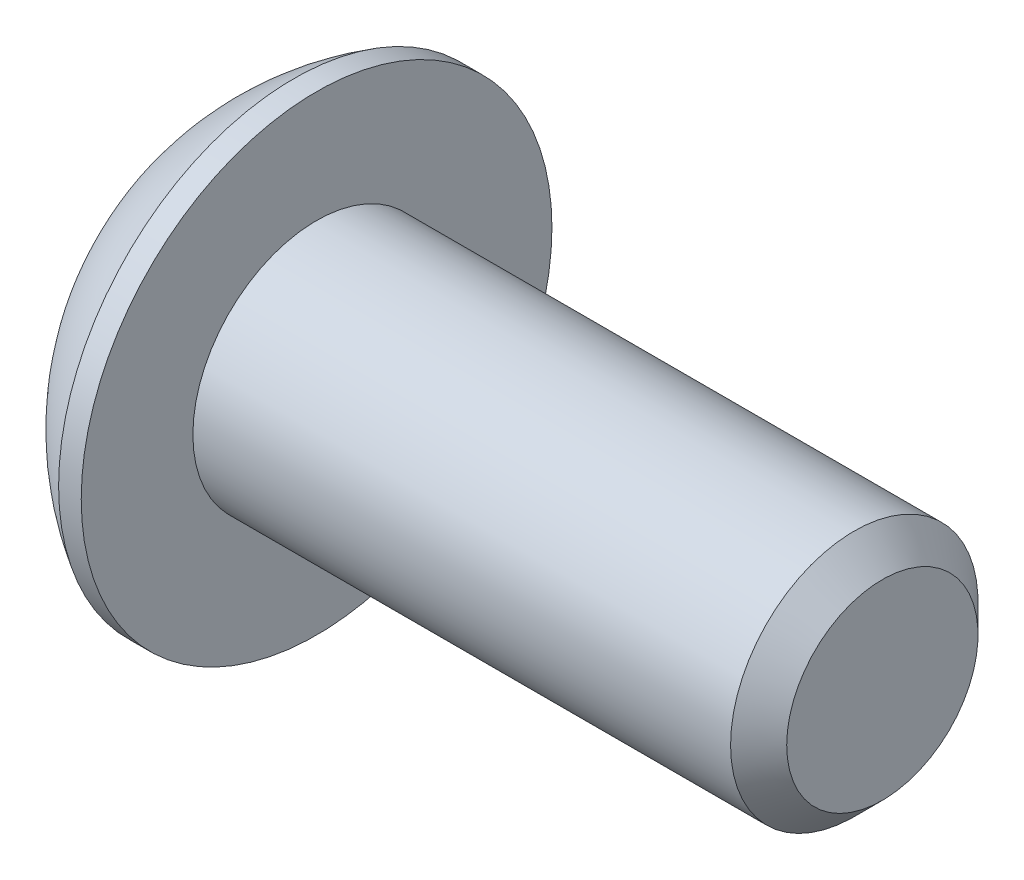
ISO-10303-21;
HEADER;
FILE_DESCRIPTION(('STEP AP214'),'2;1');
FILE_NAME('part.step','',(''),(''),'','','');
FILE_SCHEMA(('AUTOMOTIVE_DESIGN { 1 0 10303 214 1 1 1 1 }'));
ENDSEC;
DATA;
#1=APPLICATION_CONTEXT('core data for automotive mechanical design processes');
#2=APPLICATION_PROTOCOL_DEFINITION('international standard','automotive_design',2000,#1);
#3=PRODUCT_CONTEXT('',#1,'mechanical');
#4=PRODUCT('Part','Part','',(#3));
#5=PRODUCT_RELATED_PRODUCT_CATEGORY('part','',(#4));
#6=PRODUCT_DEFINITION_FORMATION('','',#4);
#7=PRODUCT_DEFINITION_CONTEXT('part definition',#1,'design');
#8=PRODUCT_DEFINITION('design','',#6,#7);
#9=PRODUCT_DEFINITION_SHAPE('','',#8);
#10=(LENGTH_UNIT() NAMED_UNIT(*) SI_UNIT(.MILLI.,.METRE.));
#11=(NAMED_UNIT(*) PLANE_ANGLE_UNIT() SI_UNIT($,.RADIAN.));
#12=(NAMED_UNIT(*) SI_UNIT($,.STERADIAN.) SOLID_ANGLE_UNIT());
#13=UNCERTAINTY_MEASURE_WITH_UNIT(LENGTH_MEASURE(1.E-05),#10,'distance_accuracy_value','');
#14=(GEOMETRIC_REPRESENTATION_CONTEXT(3) GLOBAL_UNCERTAINTY_ASSIGNED_CONTEXT((#13)) GLOBAL_UNIT_ASSIGNED_CONTEXT((#10,
#11,#12)) REPRESENTATION_CONTEXT('',''));
#15=CARTESIAN_POINT('',(0.,0.,0.));
#16=DIRECTION('',(0.,0.,1.));
#17=DIRECTION('',(1.,0.,0.));
#18=AXIS2_PLACEMENT_3D('',#15,#16,#17);
#19=CARTESIAN_POINT('',(1.32079999997359,0.,0.));
#20=DIRECTION('',(-1.,0.,0.));
#21=DIRECTION('',(0.,0.,1.));
#22=AXIS2_PLACEMENT_3D('',#19,#20,#21);
#23=CONICAL_SURFACE('',#22,1.19380000001001,1.04719755119008);
#24=CARTESIAN_POINT('',(2.0100407513155,0.,0.));
#25=VERTEX_POINT('',#24);
#26=VERTEX_LOOP('',#25);
#27=FACE_BOUND('',#26,.T.);
#28=CARTESIAN_POINT('',(1.32079999997359,0.,0.));
#29=DIRECTION('',(-1.,0.,0.));
#30=DIRECTION('',(0.,0.,1.));
#31=AXIS2_PLACEMENT_3D('',#28,#29,#30);
#32=CIRCLE('',#31,1.19380000001001);
#33=CARTESIAN_POINT('',(1.32079999998682,-1.0338611270422,0.596900000002503));
#34=VERTEX_POINT('',#33);
#35=CARTESIAN_POINT('',(1.32079999998682,0.,1.19380000000501));
#36=VERTEX_POINT('',#35);
#37=EDGE_CURVE('E92',#34,#36,#32,.T.);
#38=ORIENTED_EDGE('',*,*,#37,.T.);
#39=CARTESIAN_POINT('',(1.32079999997359,0.,0.));
#40=DIRECTION('',(-1.,0.,0.));
#41=DIRECTION('',(0.,0.,1.));
#42=AXIS2_PLACEMENT_3D('',#39,#40,#41);
#43=CIRCLE('',#42,1.19380000001001);
#44=CARTESIAN_POINT('',(1.32079999998682,1.0338611270422,0.596900000002504));
#45=VERTEX_POINT('',#44);
#46=EDGE_CURVE('E88',#36,#45,#43,.T.);
#47=ORIENTED_EDGE('',*,*,#46,.T.);
#48=CARTESIAN_POINT('',(1.32079999997359,0.,0.));
#49=DIRECTION('',(-1.,0.,0.));
#50=DIRECTION('',(0.,0.,1.));
#51=AXIS2_PLACEMENT_3D('',#48,#49,#50);
#52=CIRCLE('',#51,1.19380000001001);
#53=CARTESIAN_POINT('',(1.32079999998682,1.0338611270422,-0.596900000002504));
#54=VERTEX_POINT('',#53);
#55=EDGE_CURVE('E21',#45,#54,#52,.T.);
#56=ORIENTED_EDGE('',*,*,#55,.T.);
#57=CARTESIAN_POINT('',(1.32079999997359,0.,0.));
#58=DIRECTION('',(-1.,0.,0.));
#59=DIRECTION('',(0.,0.,1.));
#60=AXIS2_PLACEMENT_3D('',#57,#58,#59);
#61=CIRCLE('',#60,1.19380000001001);
#62=CARTESIAN_POINT('',(1.32079999998682,1.49461108489558E-12,-1.19380000000501));
#63=VERTEX_POINT('',#62);
#64=EDGE_CURVE('E151',#54,#63,#61,.T.);
#65=ORIENTED_EDGE('',*,*,#64,.T.);
#66=CARTESIAN_POINT('',(1.32079999997359,0.,0.));
#67=DIRECTION('',(-1.,0.,0.));
#68=DIRECTION('',(0.,0.,1.));
#69=AXIS2_PLACEMENT_3D('',#66,#67,#68);
#70=CIRCLE('',#69,1.19380000001001);
#71=CARTESIAN_POINT('',(1.32079999998682,-1.0338611270422,-0.596900000002503));
#72=VERTEX_POINT('',#71);
#73=EDGE_CURVE('E153',#63,#72,#70,.T.);
#74=ORIENTED_EDGE('',*,*,#73,.T.);
#75=CARTESIAN_POINT('',(1.32079999997359,0.,0.));
#76=DIRECTION('',(-1.,0.,0.));
#77=DIRECTION('',(0.,0.,1.));
#78=AXIS2_PLACEMENT_3D('',#75,#76,#77);
#79=CIRCLE('',#78,1.19380000001001);
#80=EDGE_CURVE('E155',#72,#34,#79,.T.);
#81=ORIENTED_EDGE('',*,*,#80,.T.);
#82=EDGE_LOOP('',(#38,#47,#56,#65,#74,#81));
#83=FACE_BOUND('',#82,.T.);
#84=ADVANCED_FACE('F17',(#27,#83),#23,.F.);
#85=CARTESIAN_POINT('',(1.3208,-2.06772225407572,-1.1938));
#86=DIRECTION('',(1.,0.,0.));
#87=DIRECTION('',(0.,0.,-1.));
#88=AXIS2_PLACEMENT_3D('',#85,#86,#87);
#89=PLANE('',#88);
#90=DIRECTION('',(0.,-0.5,-0.866025403784439));
#91=VECTOR('',#90,1.);
#92=CARTESIAN_POINT('',(1.32080000000004,1.37848150271715,0.));
#93=LINE('',#92,#91);
#94=CARTESIAN_POINT('',(1.32080000000001,1.37848150271715,0.));
#95=VERTEX_POINT('',#94);
#96=EDGE_CURVE('E104',#54,#95,#93,.F.);
#97=ORIENTED_EDGE('',*,*,#96,.F.);
#98=ORIENTED_EDGE('',*,*,#55,.F.);
#99=DIRECTION('',(0.,0.5,-0.866025403784439));
#100=VECTOR('',#99,1.);
#101=CARTESIAN_POINT('',(1.3208,0.689240751358576,1.1938));
#102=LINE('',#101,#100);
#103=EDGE_CURVE('E102',#95,#45,#102,.F.);
#104=ORIENTED_EDGE('',*,*,#103,.F.);
#105=EDGE_LOOP('',(#97,#98,#104));
#106=FACE_BOUND('',#105,.T.);
#107=ADVANCED_FACE('F100',(#106),#89,.F.);
#108=CARTESIAN_POINT('',(1.3208,-2.06772225407572,-1.1938));
#109=DIRECTION('',(1.,0.,0.));
#110=DIRECTION('',(0.,0.,-1.));
#111=AXIS2_PLACEMENT_3D('',#108,#109,#110);
#112=PLANE('',#111);
#113=DIRECTION('',(0.,0.5,-0.866025403784439));
#114=VECTOR('',#113,1.);
#115=CARTESIAN_POINT('',(1.32080000000004,0.689240751358576,1.1938));
#116=LINE('',#115,#114);
#117=CARTESIAN_POINT('',(1.32080000000001,0.689240751358576,1.1938));
#118=VERTEX_POINT('',#117);
#119=EDGE_CURVE('E106',#45,#118,#116,.F.);
#120=ORIENTED_EDGE('',*,*,#119,.F.);
#121=ORIENTED_EDGE('',*,*,#46,.F.);
#122=DIRECTION('',(0.,1.,0.));
#123=VECTOR('',#122,1.);
#124=CARTESIAN_POINT('',(1.3208,-0.689240751358574,1.1938));
#125=LINE('',#124,#123);
#126=EDGE_CURVE('E109',#118,#36,#125,.F.);
#127=ORIENTED_EDGE('',*,*,#126,.F.);
#128=EDGE_LOOP('',(#120,#121,#127));
#129=FACE_BOUND('',#128,.T.);
#130=ADVANCED_FACE('F107',(#129),#112,.F.);
#131=CARTESIAN_POINT('',(1.3208,-2.06772225407572,-1.1938));
#132=DIRECTION('',(1.,0.,0.));
#133=DIRECTION('',(0.,0.,-1.));
#134=AXIS2_PLACEMENT_3D('',#131,#132,#133);
#135=PLANE('',#134);
#136=DIRECTION('',(0.,1.,0.));
#137=VECTOR('',#136,1.);
#138=CARTESIAN_POINT('',(1.32080000000004,-0.689240751358574,1.1938));
#139=LINE('',#138,#137);
#140=CARTESIAN_POINT('',(1.32080000000001,-0.689240751358574,1.1938));
#141=VERTEX_POINT('',#140);
#142=EDGE_CURVE('E169',#36,#141,#139,.F.);
#143=ORIENTED_EDGE('',*,*,#142,.F.);
#144=ORIENTED_EDGE('',*,*,#37,.F.);
#145=DIRECTION('',(0.,0.5,0.866025403784439));
#146=VECTOR('',#145,1.);
#147=CARTESIAN_POINT('',(1.3208,-1.37848150271715,0.));
#148=LINE('',#147,#146);
#149=EDGE_CURVE('E167',#141,#34,#148,.F.);
#150=ORIENTED_EDGE('',*,*,#149,.F.);
#151=EDGE_LOOP('',(#143,#144,#150));
#152=FACE_BOUND('',#151,.T.);
#153=ADVANCED_FACE('F165',(#152),#135,.F.);
#154=CARTESIAN_POINT('',(1.3208,-2.06772225407572,-1.1938));
#155=DIRECTION('',(1.,0.,0.));
#156=DIRECTION('',(0.,0.,-1.));
#157=AXIS2_PLACEMENT_3D('',#154,#155,#156);
#158=PLANE('',#157);
#159=DIRECTION('',(0.,0.5,0.866025403784439));
#160=VECTOR('',#159,1.);
#161=CARTESIAN_POINT('',(1.32080000000004,-1.37848150271715,0.));
#162=LINE('',#161,#160);
#163=CARTESIAN_POINT('',(1.32080000000001,-1.37848150271715,0.));
#164=VERTEX_POINT('',#163);
#165=EDGE_CURVE('E170',#34,#164,#162,.F.);
#166=ORIENTED_EDGE('',*,*,#165,.F.);
#167=ORIENTED_EDGE('',*,*,#80,.F.);
#168=DIRECTION('',(0.,-0.5,0.866025403784439));
#169=VECTOR('',#168,1.);
#170=CARTESIAN_POINT('',(1.3208,-0.689240751358574,-1.1938));
#171=LINE('',#170,#169);
#172=EDGE_CURVE('E173',#164,#72,#171,.F.);
#173=ORIENTED_EDGE('',*,*,#172,.F.);
#174=EDGE_LOOP('',(#166,#167,#173));
#175=FACE_BOUND('',#174,.T.);
#176=ADVANCED_FACE('F171',(#175),#158,.F.);
#177=CARTESIAN_POINT('',(1.3208,-2.06772225407572,-1.1938));
#178=DIRECTION('',(1.,0.,0.));
#179=DIRECTION('',(0.,0.,-1.));
#180=AXIS2_PLACEMENT_3D('',#177,#178,#179);
#181=PLANE('',#180);
#182=DIRECTION('',(0.,-0.5,0.866025403784439));
#183=VECTOR('',#182,1.);
#184=CARTESIAN_POINT('',(1.32080000000004,-0.689240751358574,-1.1938));
#185=LINE('',#184,#183);
#186=CARTESIAN_POINT('',(1.32080000000001,-0.689240751358574,-1.1938));
#187=VERTEX_POINT('',#186);
#188=EDGE_CURVE('E228',#72,#187,#185,.F.);
#189=ORIENTED_EDGE('',*,*,#188,.F.);
#190=ORIENTED_EDGE('',*,*,#73,.F.);
#191=DIRECTION('',(0.,1.,0.));
#192=VECTOR('',#191,1.);
#193=CARTESIAN_POINT('',(1.3208,0.689240751358577,-1.1938));
#194=LINE('',#193,#192);
#195=EDGE_CURVE('E240',#187,#63,#194,.T.);
#196=ORIENTED_EDGE('',*,*,#195,.F.);
#197=EDGE_LOOP('',(#189,#190,#196));
#198=FACE_BOUND('',#197,.T.);
#199=ADVANCED_FACE('F369',(#198),#181,.F.);
#200=CARTESIAN_POINT('',(1.3208,-2.06772225407572,-1.1938));
#201=DIRECTION('',(1.,0.,0.));
#202=DIRECTION('',(0.,0.,-1.));
#203=AXIS2_PLACEMENT_3D('',#200,#201,#202);
#204=PLANE('',#203);
#205=DIRECTION('',(0.,1.,0.));
#206=VECTOR('',#205,1.);
#207=CARTESIAN_POINT('',(1.32080000000004,0.689240751358577,-1.1938));
#208=LINE('',#207,#206);
#209=CARTESIAN_POINT('',(1.32080000000002,0.689240751358565,-1.19380000000002));
#210=VERTEX_POINT('',#209);
#211=EDGE_CURVE('E248',#63,#210,#208,.T.);
#212=ORIENTED_EDGE('',*,*,#211,.F.);
#213=ORIENTED_EDGE('',*,*,#64,.F.);
#214=DIRECTION('',(0.,-0.5,-0.866025403784439));
#215=VECTOR('',#214,1.);
#216=CARTESIAN_POINT('',(1.3208,1.37848150271715,0.));
#217=LINE('',#216,#215);
#218=EDGE_CURVE('E128',#210,#54,#217,.F.);
#219=ORIENTED_EDGE('',*,*,#218,.F.);
#220=EDGE_LOOP('',(#212,#213,#219));
#221=FACE_BOUND('',#220,.T.);
#222=ADVANCED_FACE('F361',(#221),#204,.F.);
#223=CARTESIAN_POINT('',(1.3208,1.37848150271715,0.));
#224=DIRECTION('',(0.,-0.866025403784439,0.5));
#225=DIRECTION('',(0.,-0.5,-0.866025403784439));
#226=AXIS2_PLACEMENT_3D('',#223,#224,#225);
#227=PLANE('',#226);
#228=ORIENTED_EDGE('',*,*,#96,.T.);
#229=DIRECTION('',(1.,0.,0.));
#230=VECTOR('',#229,1.);
#231=CARTESIAN_POINT('',(1.3208,1.37848150271715,0.));
#232=LINE('',#231,#230);
#233=CARTESIAN_POINT('',(0.,1.37848150271715,0.));
#234=VERTEX_POINT('',#233);
#235=EDGE_CURVE('E116',#234,#95,#232,.T.);
#236=ORIENTED_EDGE('',*,*,#235,.F.);
#237=DIRECTION('',(0.,0.5,0.866025403784439));
#238=VECTOR('',#237,1.);
#239=CARTESIAN_POINT('',(0.,0.689240751358577,-1.1938));
#240=LINE('',#239,#238);
#241=CARTESIAN_POINT('',(0.,0.689240751358577,-1.1938));
#242=VERTEX_POINT('',#241);
#243=EDGE_CURVE('E131',#242,#234,#240,.T.);
#244=ORIENTED_EDGE('',*,*,#243,.F.);
#245=DIRECTION('',(1.,0.,0.));
#246=VECTOR('',#245,1.);
#247=CARTESIAN_POINT('',(1.3208,0.689240751358577,-1.1938));
#248=LINE('',#247,#246);
#249=EDGE_CURVE('E135',#210,#242,#248,.F.);
#250=ORIENTED_EDGE('',*,*,#249,.F.);
#251=ORIENTED_EDGE('',*,*,#218,.T.);
#252=EDGE_LOOP('',(#228,#236,#244,#250,#251));
#253=FACE_BOUND('',#252,.T.);
#254=ADVANCED_FACE('F354',(#253),#227,.T.);
#255=CARTESIAN_POINT('',(1.3208,0.689240751358576,1.1938));
#256=DIRECTION('',(0.,-0.866025403784439,-0.5));
#257=DIRECTION('',(0.,0.5,-0.866025403784439));
#258=AXIS2_PLACEMENT_3D('',#255,#256,#257);
#259=PLANE('',#258);
#260=ORIENTED_EDGE('',*,*,#119,.T.);
#261=DIRECTION('',(1.,0.,0.));
#262=VECTOR('',#261,1.);
#263=CARTESIAN_POINT('',(1.3208,0.689240751358576,1.1938));
#264=LINE('',#263,#262);
#265=CARTESIAN_POINT('',(0.,0.689240751358577,1.1938));
#266=VERTEX_POINT('',#265);
#267=EDGE_CURVE('E112',#266,#118,#264,.T.);
#268=ORIENTED_EDGE('',*,*,#267,.F.);
#269=DIRECTION('',(0.,-0.5,0.866025403784439));
#270=VECTOR('',#269,1.);
#271=CARTESIAN_POINT('',(0.,1.37848150271715,0.));
#272=LINE('',#271,#270);
#273=EDGE_CURVE('E134',#234,#266,#272,.T.);
#274=ORIENTED_EDGE('',*,*,#273,.F.);
#275=ORIENTED_EDGE('',*,*,#235,.T.);
#276=ORIENTED_EDGE('',*,*,#103,.T.);
#277=EDGE_LOOP('',(#260,#268,#274,#275,#276));
#278=FACE_BOUND('',#277,.T.);
#279=ADVANCED_FACE('F114',(#278),#259,.T.);
#280=CARTESIAN_POINT('',(1.3208,-0.689240751358574,1.1938));
#281=DIRECTION('',(0.,0.,-1.));
#282=DIRECTION('',(0.,1.,0.));
#283=AXIS2_PLACEMENT_3D('',#280,#281,#282);
#284=PLANE('',#283);
#285=ORIENTED_EDGE('',*,*,#142,.T.);
#286=DIRECTION('',(1.,0.,0.));
#287=VECTOR('',#286,1.);
#288=CARTESIAN_POINT('',(1.3208,-0.689240751358574,1.1938));
#289=LINE('',#288,#287);
#290=CARTESIAN_POINT('',(0.,-0.689240751358574,1.1938));
#291=VERTEX_POINT('',#290);
#292=EDGE_CURVE('E180',#291,#141,#289,.T.);
#293=ORIENTED_EDGE('',*,*,#292,.F.);
#294=DIRECTION('',(0.,1.,0.));
#295=VECTOR('',#294,1.);
#296=CARTESIAN_POINT('',(0.,0.,1.1938));
#297=LINE('',#296,#295);
#298=EDGE_CURVE('E194',#266,#291,#297,.F.);
#299=ORIENTED_EDGE('',*,*,#298,.F.);
#300=ORIENTED_EDGE('',*,*,#267,.T.);
#301=ORIENTED_EDGE('',*,*,#126,.T.);
#302=EDGE_LOOP('',(#285,#293,#299,#300,#301));
#303=FACE_BOUND('',#302,.T.);
#304=ADVANCED_FACE('F216',(#303),#284,.T.);
#305=CARTESIAN_POINT('',(1.3208,-1.37848150271715,0.));
#306=DIRECTION('',(0.,0.866025403784439,-0.5));
#307=DIRECTION('',(0.,0.5,0.866025403784439));
#308=AXIS2_PLACEMENT_3D('',#305,#306,#307);
#309=PLANE('',#308);
#310=ORIENTED_EDGE('',*,*,#165,.T.);
#311=DIRECTION('',(1.,0.,0.));
#312=VECTOR('',#311,1.);
#313=CARTESIAN_POINT('',(1.3208,-1.37848150271715,0.));
#314=LINE('',#313,#312);
#315=CARTESIAN_POINT('',(0.,-1.37848150271715,0.));
#316=VERTEX_POINT('',#315);
#317=EDGE_CURVE('E176',#316,#164,#314,.T.);
#318=ORIENTED_EDGE('',*,*,#317,.F.);
#319=DIRECTION('',(0.,-0.5,-0.866025403784439));
#320=VECTOR('',#319,1.);
#321=CARTESIAN_POINT('',(0.,-0.689240751358574,1.1938));
#322=LINE('',#321,#320);
#323=EDGE_CURVE('E197',#291,#316,#322,.T.);
#324=ORIENTED_EDGE('',*,*,#323,.F.);
#325=ORIENTED_EDGE('',*,*,#292,.T.);
#326=ORIENTED_EDGE('',*,*,#149,.T.);
#327=EDGE_LOOP('',(#310,#318,#324,#325,#326));
#328=FACE_BOUND('',#327,.T.);
#329=ADVANCED_FACE('F178',(#328),#309,.T.);
#330=CARTESIAN_POINT('',(1.3208,-0.689240751358574,-1.1938));
#331=DIRECTION('',(0.,0.866025403784439,0.5));
#332=DIRECTION('',(0.,-0.5,0.866025403784439));
#333=AXIS2_PLACEMENT_3D('',#330,#331,#332);
#334=PLANE('',#333);
#335=ORIENTED_EDGE('',*,*,#188,.T.);
#336=DIRECTION('',(1.,0.,0.));
#337=VECTOR('',#336,1.);
#338=CARTESIAN_POINT('',(1.3208,-0.689240751358574,-1.1938));
#339=LINE('',#338,#337);
#340=CARTESIAN_POINT('',(0.,-0.689240751358574,-1.1938));
#341=VERTEX_POINT('',#340);
#342=EDGE_CURVE('E36',#341,#187,#339,.T.);
#343=ORIENTED_EDGE('',*,*,#342,.F.);
#344=DIRECTION('',(0.,0.5,-0.866025403784439));
#345=VECTOR('',#344,1.);
#346=CARTESIAN_POINT('',(0.,-1.37848150271715,0.));
#347=LINE('',#346,#345);
#348=EDGE_CURVE('E217',#316,#341,#347,.T.);
#349=ORIENTED_EDGE('',*,*,#348,.F.);
#350=ORIENTED_EDGE('',*,*,#317,.T.);
#351=ORIENTED_EDGE('',*,*,#172,.T.);
#352=EDGE_LOOP('',(#335,#343,#349,#350,#351));
#353=FACE_BOUND('',#352,.T.);
#354=ADVANCED_FACE('F328',(#353),#334,.T.);
#355=CARTESIAN_POINT('',(1.3208,0.689240751358577,-1.1938));
#356=DIRECTION('',(0.,0.,1.));
#357=DIRECTION('',(1.,0.,0.));
#358=AXIS2_PLACEMENT_3D('',#355,#356,#357);
#359=PLANE('',#358);
#360=ORIENTED_EDGE('',*,*,#211,.T.);
#361=ORIENTED_EDGE('',*,*,#249,.T.);
#362=DIRECTION('',(0.,1.,0.));
#363=VECTOR('',#362,1.);
#364=CARTESIAN_POINT('',(0.,0.,-1.1938));
#365=LINE('',#364,#363);
#366=EDGE_CURVE('E150',#341,#242,#365,.T.);
#367=ORIENTED_EDGE('',*,*,#366,.F.);
#368=ORIENTED_EDGE('',*,*,#342,.T.);
#369=ORIENTED_EDGE('',*,*,#195,.T.);
#370=EDGE_LOOP('',(#360,#361,#367,#368,#369));
#371=FACE_BOUND('',#370,.T.);
#372=ADVANCED_FACE('F321',(#371),#359,.T.);
#373=CARTESIAN_POINT('',(0.,0.,0.));
#374=DIRECTION('',(-1.,0.,0.));
#375=DIRECTION('',(0.,0.,1.));
#376=AXIS2_PLACEMENT_3D('',#373,#374,#375);
#377=PLANE('',#376);
#378=CARTESIAN_POINT('',(0.,0.,0.));
#379=DIRECTION('',(-1.,0.,0.));
#380=DIRECTION('',(0.,0.,1.));
#381=AXIS2_PLACEMENT_3D('',#378,#379,#380);
#382=CIRCLE('',#381,1.9812);
#383=CARTESIAN_POINT('',(0.,0.,1.9812));
#384=VERTEX_POINT('',#383);
#385=EDGE_CURVE('E147',#384,#384,#382,.F.);
#386=ORIENTED_EDGE('',*,*,#385,.F.);
#387=EDGE_LOOP('',(#386));
#388=FACE_BOUND('',#387,.T.);
#389=ORIENTED_EDGE('',*,*,#348,.T.);
#390=ORIENTED_EDGE('',*,*,#366,.T.);
#391=ORIENTED_EDGE('',*,*,#243,.T.);
#392=ORIENTED_EDGE('',*,*,#273,.T.);
#393=ORIENTED_EDGE('',*,*,#298,.T.);
#394=ORIENTED_EDGE('',*,*,#323,.T.);
#395=EDGE_LOOP('',(#389,#390,#391,#392,#393,#394));
#396=FACE_BOUND('',#395,.T.);
#397=ADVANCED_FACE('F210',(#388,#396),#377,.T.);
#398=CARTESIAN_POINT('',(4.13385,0.,0.));
#399=DIRECTION('',(0.,1.,0.));
#400=DIRECTION('',(-0.489667403954941,0.,-0.87190930348519));
#401=AXIS2_PLACEMENT_3D('',#398,#399,#400);
#402=SPHERICAL_SURFACE('',#401,4.58408870578439);
#403=CARTESIAN_POINT('',(4.13385,0.,0.));
#404=DIRECTION('',(-1.,0.,0.));
#405=DIRECTION('',(0.,0.,1.));
#406=AXIS2_PLACEMENT_3D('',#403,#404,#405);
#407=SPHERICAL_SURFACE('',#406,4.58408870578439);
#408=ORIENTED_EDGE('',*,*,#385,.T.);
#409=EDGE_LOOP('',(#408));
#410=FACE_BOUND('',#409,.T.);
#411=CARTESIAN_POINT('',(1.8288,0.,0.));
#412=DIRECTION('',(-1.,0.,0.));
#413=DIRECTION('',(0.,0.,1.));
#414=AXIS2_PLACEMENT_3D('',#411,#412,#413);
#415=CIRCLE('',#414,3.9624);
#416=CARTESIAN_POINT('',(1.8288,0.,3.9624));
#417=VERTEX_POINT('',#416);
#418=EDGE_CURVE('E144',#417,#417,#415,.F.);
#419=ORIENTED_EDGE('',*,*,#418,.F.);
#420=EDGE_LOOP('',(#419));
#421=FACE_BOUND('',#420,.T.);
#422=ADVANCED_FACE('F19',(#410,#421),#407,.T.);
#423=CARTESIAN_POINT('',(11.7348,0.,0.));
#424=DIRECTION('',(-1.,0.,0.));
#425=DIRECTION('',(0.,0.,1.));
#426=AXIS2_PLACEMENT_3D('',#423,#424,#425);
#427=PLANE('',#426);
#428=CARTESIAN_POINT('',(11.7347999999993,0.,0.));
#429=DIRECTION('',(-1.,0.,0.));
#430=DIRECTION('',(0.,0.,1.));
#431=AXIS2_PLACEMENT_3D('',#428,#429,#430);
#432=CIRCLE('',#431,1.61035999997239);
#433=CARTESIAN_POINT('',(11.7347999999993,0.,1.61035999997239));
#434=VERTEX_POINT('',#433);
#435=EDGE_CURVE('E141',#434,#434,#432,.T.);
#436=ORIENTED_EDGE('',*,*,#435,.F.);
#437=EDGE_LOOP('',(#436));
#438=FACE_BOUND('',#437,.T.);
#439=ADVANCED_FACE('F270',(#438),#427,.F.);
#440=CARTESIAN_POINT('',(0.,0.,0.));
#441=DIRECTION('',(-1.,0.,0.));
#442=DIRECTION('',(0.,0.,1.));
#443=AXIS2_PLACEMENT_3D('',#440,#441,#442);
#444=CYLINDRICAL_SURFACE('',#443,3.9624);
#445=ORIENTED_EDGE('',*,*,#418,.T.);
#446=EDGE_LOOP('',(#445));
#447=FACE_BOUND('',#446,.T.);
#448=CARTESIAN_POINT('',(2.2098,0.,0.));
#449=DIRECTION('',(-1.,0.,0.));
#450=DIRECTION('',(0.,0.,1.));
#451=AXIS2_PLACEMENT_3D('',#448,#449,#450);
#452=CIRCLE('',#451,3.9624);
#453=CARTESIAN_POINT('',(2.2098,0.,3.9624));
#454=VERTEX_POINT('',#453);
#455=EDGE_CURVE('E138',#454,#454,#452,.T.);
#456=ORIENTED_EDGE('',*,*,#455,.T.);
#457=EDGE_LOOP('',(#456));
#458=FACE_BOUND('',#457,.T.);
#459=ADVANCED_FACE('F266',(#447,#458),#444,.T.);
#460=CARTESIAN_POINT('',(11.2623600001029,0.,0.));
#461=DIRECTION('',(-1.,0.,0.));
#462=DIRECTION('',(0.,0.,1.));
#463=AXIS2_PLACEMENT_3D('',#460,#461,#462);
#464=CONICAL_SURFACE('',#463,2.08279999986871,0.785398163397448);
#465=CARTESIAN_POINT('',(11.26236,0.,0.));
#466=DIRECTION('',(-1.,0.,0.));
#467=DIRECTION('',(0.,0.,1.));
#468=AXIS2_PLACEMENT_3D('',#465,#466,#467);
#469=CIRCLE('',#468,2.0828);
#470=CARTESIAN_POINT('',(11.26236,0.,2.0828));
#471=VERTEX_POINT('',#470);
#472=EDGE_CURVE('E27',#471,#471,#469,.T.);
#473=ORIENTED_EDGE('',*,*,#472,.F.);
#474=EDGE_LOOP('',(#473));
#475=FACE_BOUND('',#474,.T.);
#476=ORIENTED_EDGE('',*,*,#435,.T.);
#477=EDGE_LOOP('',(#476));
#478=FACE_BOUND('',#477,.T.);
#479=ADVANCED_FACE('F262',(#475,#478),#464,.T.);
#480=CARTESIAN_POINT('',(2.2098,2.0828,0.));
#481=DIRECTION('',(-1.,0.,0.));
#482=DIRECTION('',(0.,0.,1.));
#483=AXIS2_PLACEMENT_3D('',#480,#481,#482);
#484=PLANE('',#483);
#485=ORIENTED_EDGE('',*,*,#455,.F.);
#486=EDGE_LOOP('',(#485));
#487=FACE_BOUND('',#486,.T.);
#488=CARTESIAN_POINT('',(2.2098,0.,0.));
#489=DIRECTION('',(-1.,0.,0.));
#490=DIRECTION('',(0.,0.,1.));
#491=AXIS2_PLACEMENT_3D('',#488,#489,#490);
#492=CIRCLE('',#491,2.0828);
#493=CARTESIAN_POINT('',(2.2098,0.,2.0828));
#494=VERTEX_POINT('',#493);
#495=EDGE_CURVE('E11',#494,#494,#492,.F.);
#496=ORIENTED_EDGE('',*,*,#495,.F.);
#497=EDGE_LOOP('',(#496));
#498=FACE_BOUND('',#497,.T.);
#499=ADVANCED_FACE('F265',(#487,#498),#484,.F.);
#500=CARTESIAN_POINT('',(0.,0.,0.));
#501=DIRECTION('',(-1.,0.,0.));
#502=DIRECTION('',(0.,0.,1.));
#503=AXIS2_PLACEMENT_3D('',#500,#501,#502);
#504=CYLINDRICAL_SURFACE('',#503,2.0828);
#505=ORIENTED_EDGE('',*,*,#495,.T.);
#506=EDGE_LOOP('',(#505));
#507=FACE_BOUND('',#506,.T.);
#508=ORIENTED_EDGE('',*,*,#472,.T.);
#509=EDGE_LOOP('',(#508));
#510=FACE_BOUND('',#509,.T.);
#511=ADVANCED_FACE('F260',(#507,#510),#504,.T.);
#512=CLOSED_SHELL('',(#84,#107,#130,#153,#176,#199,#222,#254,#279,#304,#329,#354,#372,#397,#422,
#439,#459,#479,#499,#511));
#513=MANIFOLD_SOLID_BREP('B1',#512);
#514=ADVANCED_BREP_SHAPE_REPRESENTATION('',(#18,#513),#14);
#515=SHAPE_DEFINITION_REPRESENTATION(#9,#514);
ENDSEC;
END-ISO-10303-21;
